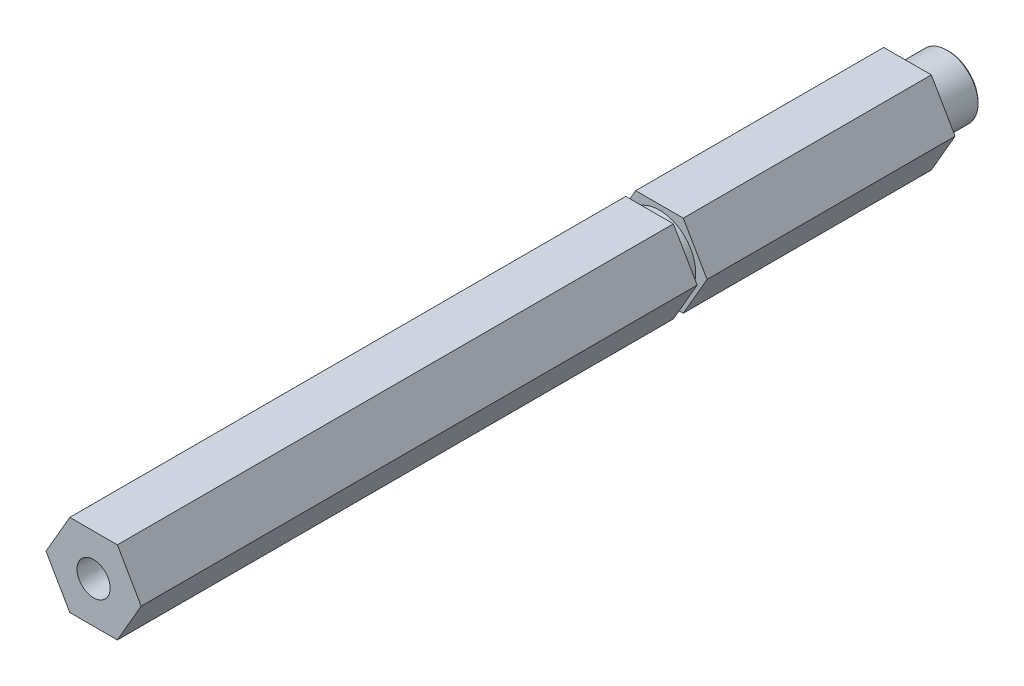
ISO-10303-21;
HEADER;
FILE_DESCRIPTION(('STEP AP214'),'2;1');
FILE_NAME('part.step','',(''),(''),'','','');
FILE_SCHEMA(('AUTOMOTIVE_DESIGN { 1 0 10303 214 1 1 1 1 }'));
ENDSEC;
DATA;
#1=APPLICATION_CONTEXT('core data for automotive mechanical design processes');
#2=APPLICATION_PROTOCOL_DEFINITION('international standard','automotive_design',2000,#1);
#3=PRODUCT_CONTEXT('',#1,'mechanical');
#4=PRODUCT('Part','Part','',(#3));
#5=PRODUCT_RELATED_PRODUCT_CATEGORY('part','',(#4));
#6=PRODUCT_DEFINITION_FORMATION('','',#4);
#7=PRODUCT_DEFINITION_CONTEXT('part definition',#1,'design');
#8=PRODUCT_DEFINITION('design','',#6,#7);
#9=PRODUCT_DEFINITION_SHAPE('','',#8);
#10=(LENGTH_UNIT() NAMED_UNIT(*) SI_UNIT(.MILLI.,.METRE.));
#11=(NAMED_UNIT(*) PLANE_ANGLE_UNIT() SI_UNIT($,.RADIAN.));
#12=(NAMED_UNIT(*) SI_UNIT($,.STERADIAN.) SOLID_ANGLE_UNIT());
#13=UNCERTAINTY_MEASURE_WITH_UNIT(LENGTH_MEASURE(1.E-05),#10,'distance_accuracy_value','');
#14=(GEOMETRIC_REPRESENTATION_CONTEXT(3) GLOBAL_UNCERTAINTY_ASSIGNED_CONTEXT((#13)) GLOBAL_UNIT_ASSIGNED_CONTEXT((#10,
#11,#12)) REPRESENTATION_CONTEXT('',''));
#15=CARTESIAN_POINT('',(0.,0.,0.));
#16=DIRECTION('',(0.,0.,1.));
#17=DIRECTION('',(1.,0.,0.));
#18=AXIS2_PLACEMENT_3D('',#15,#16,#17);
#19=CARTESIAN_POINT('',(0.,0.,11.176));
#20=DIRECTION('',(0.,0.,-1.));
#21=DIRECTION('',(-1.,0.,0.));
#22=AXIS2_PLACEMENT_3D('',#19,#20,#21);
#23=PLANE('',#22);
#24=CARTESIAN_POINT('',(0.,0.,11.176));
#25=DIRECTION('',(0.,0.,-1.));
#26=DIRECTION('',(-1.,0.,0.));
#27=AXIS2_PLACEMENT_3D('',#24,#25,#26);
#28=CIRCLE('',#27,3.175);
#29=CARTESIAN_POINT('',(-3.175,0.,11.176));
#30=VERTEX_POINT('',#29);
#31=EDGE_CURVE('E20',#30,#30,#28,.T.);
#32=ORIENTED_EDGE('',*,*,#31,.T.);
#33=EDGE_LOOP('',(#32));
#34=FACE_BOUND('',#33,.T.);
#35=ADVANCED_FACE('F17',(#34),#23,.T.);
#36=CARTESIAN_POINT('',(0.,0.,11.176));
#37=DIRECTION('',(0.,0.,-1.));
#38=DIRECTION('',(-1.,0.,0.));
#39=AXIS2_PLACEMENT_3D('',#36,#37,#38);
#40=CYLINDRICAL_SURFACE('',#39,3.175);
#41=CARTESIAN_POINT('',(0.,0.,0.254000000040833));
#42=DIRECTION('',(0.,0.,-1.));
#43=DIRECTION('',(-1.,0.,0.));
#44=AXIS2_PLACEMENT_3D('',#41,#42,#43);
#45=CIRCLE('',#44,3.17499999999882);
#46=CARTESIAN_POINT('',(-3.17499999999882,0.,0.254000000040833));
#47=VERTEX_POINT('',#46);
#48=EDGE_CURVE('E139',#47,#47,#45,.T.);
#49=ORIENTED_EDGE('',*,*,#48,.T.);
#50=EDGE_LOOP('',(#49));
#51=FACE_BOUND('',#50,.T.);
#52=ORIENTED_EDGE('',*,*,#31,.F.);
#53=EDGE_LOOP('',(#52));
#54=FACE_BOUND('',#53,.T.);
#55=ADVANCED_FACE('F401',(#51,#54),#40,.F.);
#56=CARTESIAN_POINT('',(0.,0.,5.6843418860808E-11));
#57=DIRECTION('',(0.,0.,-1.));
#58=DIRECTION('',(-1.,0.,0.));
#59=AXIS2_PLACEMENT_3D('',#56,#57,#58);
#60=CONICAL_SURFACE('',#59,3.42899999998281,0.785398163285552);
#61=CARTESIAN_POINT('',(0.,0.,0.));
#62=DIRECTION('',(0.,0.,-1.));
#63=DIRECTION('',(-1.,0.,0.));
#64=AXIS2_PLACEMENT_3D('',#61,#62,#63);
#65=CIRCLE('',#64,3.42900000003965);
#66=CARTESIAN_POINT('',(-3.42900000003965,0.,0.));
#67=VERTEX_POINT('',#66);
#68=EDGE_CURVE('E142',#67,#67,#65,.T.);
#69=ORIENTED_EDGE('',*,*,#68,.T.);
#70=EDGE_LOOP('',(#69));
#71=FACE_BOUND('',#70,.T.);
#72=ORIENTED_EDGE('',*,*,#48,.F.);
#73=EDGE_LOOP('',(#72));
#74=FACE_BOUND('',#73,.T.);
#75=ADVANCED_FACE('F163',(#71,#74),#60,.F.);
#76=CARTESIAN_POINT('',(0.,0.,0.));
#77=DIRECTION('',(0.,0.,1.));
#78=DIRECTION('',(1.,0.,0.));
#79=AXIS2_PLACEMENT_3D('',#76,#77,#78);
#80=PLANE('',#79);
#81=ORIENTED_EDGE('',*,*,#68,.F.);
#82=EDGE_LOOP('',(#81));
#83=FACE_BOUND('',#82,.T.);
#84=CARTESIAN_POINT('',(0.,0.,-5.6843418860808E-11));
#85=DIRECTION('',(0.,0.,1.));
#86=DIRECTION('',(1.,0.,0.));
#87=AXIS2_PLACEMENT_3D('',#84,#85,#86);
#88=CIRCLE('',#87,4.50850000004266);
#89=CARTESIAN_POINT('',(4.50850000004266,0.,-5.6843418860808E-11));
#90=VERTEX_POINT('',#89);
#91=EDGE_CURVE('E138',#90,#90,#88,.T.);
#92=ORIENTED_EDGE('',*,*,#91,.F.);
#93=EDGE_LOOP('',(#92));
#94=FACE_BOUND('',#93,.T.);
#95=ADVANCED_FACE('F166',(#83,#94),#80,.F.);
#96=CARTESIAN_POINT('',(0.,0.,0.253999999870302));
#97=DIRECTION('',(0.,0.,1.));
#98=DIRECTION('',(1.,0.,0.));
#99=AXIS2_PLACEMENT_3D('',#96,#97,#98);
#100=CONICAL_SURFACE('',#99,4.7624999999698,0.785398163397448);
#101=ORIENTED_EDGE('',*,*,#91,.T.);
#102=EDGE_LOOP('',(#101));
#103=FACE_BOUND('',#102,.T.);
#104=CARTESIAN_POINT('',(0.,0.,0.253999999999998));
#105=DIRECTION('',(0.,0.,-1.));
#106=DIRECTION('',(-1.,0.,0.));
#107=AXIS2_PLACEMENT_3D('',#104,#105,#106);
#108=CIRCLE('',#107,4.7625);
#109=CARTESIAN_POINT('',(-4.7625,0.,0.253999999999998));
#110=VERTEX_POINT('',#109);
#111=EDGE_CURVE('E135',#110,#110,#108,.F.);
#112=ORIENTED_EDGE('',*,*,#111,.F.);
#113=EDGE_LOOP('',(#112));
#114=FACE_BOUND('',#113,.T.);
#115=ADVANCED_FACE('F169',(#103,#114),#100,.T.);
#116=CARTESIAN_POINT('',(0.,0.,6.35));
#117=DIRECTION('',(0.,0.,-1.));
#118=DIRECTION('',(-1.,0.,0.));
#119=AXIS2_PLACEMENT_3D('',#116,#117,#118);
#120=CYLINDRICAL_SURFACE('',#119,4.7625);
#121=CARTESIAN_POINT('',(0.,0.,6.35));
#122=DIRECTION('',(0.,0.,-1.));
#123=DIRECTION('',(-1.,0.,0.));
#124=AXIS2_PLACEMENT_3D('',#121,#122,#123);
#125=CIRCLE('',#124,4.7625);
#126=CARTESIAN_POINT('',(-4.7625,0.,6.35));
#127=VERTEX_POINT('',#126);
#128=EDGE_CURVE('E117',#127,#127,#125,.T.);
#129=ORIENTED_EDGE('',*,*,#128,.T.);
#130=EDGE_LOOP('',(#129));
#131=FACE_BOUND('',#130,.T.);
#132=ORIENTED_EDGE('',*,*,#111,.T.);
#133=EDGE_LOOP('',(#132));
#134=FACE_BOUND('',#133,.T.);
#135=ADVANCED_FACE('F175',(#131,#134),#120,.T.);
#136=CARTESIAN_POINT('',(0.,0.,6.35));
#137=DIRECTION('',(0.,0.,1.));
#138=DIRECTION('',(1.,0.,0.));
#139=AXIS2_PLACEMENT_3D('',#136,#137,#138);
#140=PLANE('',#139);
#141=ORIENTED_EDGE('',*,*,#128,.F.);
#142=EDGE_LOOP('',(#141));
#143=FACE_BOUND('',#142,.T.);
#144=DIRECTION('',(-1.,0.,0.));
#145=VECTOR('',#144,1.);
#146=CARTESIAN_POINT('',(-3.66617420935412,-6.35,6.35));
#147=LINE('',#146,#145);
#148=CARTESIAN_POINT('',(3.66617420935412,-6.35,6.35));
#149=VERTEX_POINT('',#148);
#150=CARTESIAN_POINT('',(-3.66617420935412,-6.35,6.35));
#151=VERTEX_POINT('',#150);
#152=EDGE_CURVE('E481',#149,#151,#147,.T.);
#153=ORIENTED_EDGE('',*,*,#152,.T.);
#154=DIRECTION('',(-0.5,0.866025403784438,0.));
#155=VECTOR('',#154,1.);
#156=CARTESIAN_POINT('',(-7.33234841870825,0.,6.35));
#157=LINE('',#156,#155);
#158=CARTESIAN_POINT('',(-7.33234841870825,0.,6.35));
#159=VERTEX_POINT('',#158);
#160=EDGE_CURVE('E491',#151,#159,#157,.T.);
#161=ORIENTED_EDGE('',*,*,#160,.T.);
#162=DIRECTION('',(0.5,0.866025403784439,0.));
#163=VECTOR('',#162,1.);
#164=CARTESIAN_POINT('',(-3.66617420935412,6.35,6.35));
#165=LINE('',#164,#163);
#166=CARTESIAN_POINT('',(-3.66617420935412,6.35,6.35));
#167=VERTEX_POINT('',#166);
#168=EDGE_CURVE('E463',#159,#167,#165,.T.);
#169=ORIENTED_EDGE('',*,*,#168,.T.);
#170=DIRECTION('',(1.,0.,0.));
#171=VECTOR('',#170,1.);
#172=CARTESIAN_POINT('',(3.66617420935412,6.35,6.35));
#173=LINE('',#172,#171);
#174=CARTESIAN_POINT('',(3.66617420935412,6.35,6.35));
#175=VERTEX_POINT('',#174);
#176=EDGE_CURVE('E129',#167,#175,#173,.T.);
#177=ORIENTED_EDGE('',*,*,#176,.T.);
#178=DIRECTION('',(0.5,-0.866025403784439,0.));
#179=VECTOR('',#178,1.);
#180=CARTESIAN_POINT('',(7.33234841870825,0.,6.34999999999999));
#181=LINE('',#180,#179);
#182=CARTESIAN_POINT('',(7.33234841870825,0.,6.35));
#183=VERTEX_POINT('',#182);
#184=EDGE_CURVE('E122',#175,#183,#181,.T.);
#185=ORIENTED_EDGE('',*,*,#184,.T.);
#186=DIRECTION('',(-0.5,-0.866025403784439,0.));
#187=VECTOR('',#186,1.);
#188=CARTESIAN_POINT('',(3.66617420935412,-6.35,6.35));
#189=LINE('',#188,#187);
#190=EDGE_CURVE('E106',#183,#149,#189,.T.);
#191=ORIENTED_EDGE('',*,*,#190,.T.);
#192=EDGE_LOOP('',(#153,#161,#169,#177,#185,#191));
#193=FACE_BOUND('',#192,.T.);
#194=ADVANCED_FACE('F127',(#143,#193),#140,.F.);
#195=CARTESIAN_POINT('',(3.66617420935412,-6.35,44.577));
#196=DIRECTION('',(-0.866025403784439,0.5,0.));
#197=DIRECTION('',(-0.5,-0.866025403784439,0.));
#198=AXIS2_PLACEMENT_3D('',#195,#196,#197);
#199=PLANE('',#198);
#200=DIRECTION('',(0.,0.,1.));
#201=VECTOR('',#200,1.);
#202=CARTESIAN_POINT('',(7.33234841870825,0.,44.577));
#203=LINE('',#202,#201);
#204=CARTESIAN_POINT('',(7.33234841870825,0.,44.577));
#205=VERTEX_POINT('',#204);
#206=EDGE_CURVE('E110',#183,#205,#203,.T.);
#207=ORIENTED_EDGE('',*,*,#206,.T.);
#208=DIRECTION('',(0.5,0.866025403784439,0.));
#209=VECTOR('',#208,1.);
#210=CARTESIAN_POINT('',(3.66617420935412,-6.35,44.577));
#211=LINE('',#210,#209);
#212=CARTESIAN_POINT('',(3.66617420935412,-6.35,44.577));
#213=VERTEX_POINT('',#212);
#214=EDGE_CURVE('E479',#213,#205,#211,.T.);
#215=ORIENTED_EDGE('',*,*,#214,.F.);
#216=DIRECTION('',(0.,0.,1.));
#217=VECTOR('',#216,1.);
#218=CARTESIAN_POINT('',(3.66617420935412,-6.35,44.577));
#219=LINE('',#218,#217);
#220=EDGE_CURVE('E112',#213,#149,#219,.F.);
#221=ORIENTED_EDGE('',*,*,#220,.T.);
#222=ORIENTED_EDGE('',*,*,#190,.F.);
#223=EDGE_LOOP('',(#207,#215,#221,#222));
#224=FACE_BOUND('',#223,.T.);
#225=ADVANCED_FACE('F108',(#224),#199,.F.);
#226=CARTESIAN_POINT('',(7.33234841870825,0.,44.577));
#227=DIRECTION('',(-0.866025403784439,-0.5,0.));
#228=DIRECTION('',(0.5,-0.866025403784439,0.));
#229=AXIS2_PLACEMENT_3D('',#226,#227,#228);
#230=PLANE('',#229);
#231=DIRECTION('',(0.,0.,-1.));
#232=VECTOR('',#231,1.);
#233=CARTESIAN_POINT('',(3.66617420935412,6.35,44.577));
#234=LINE('',#233,#232);
#235=CARTESIAN_POINT('',(3.66617420935412,6.35,44.577));
#236=VERTEX_POINT('',#235);
#237=EDGE_CURVE('E130',#175,#236,#234,.F.);
#238=ORIENTED_EDGE('',*,*,#237,.T.);
#239=DIRECTION('',(-0.5,0.866025403784438,0.));
#240=VECTOR('',#239,1.);
#241=CARTESIAN_POINT('',(7.33234841870825,0.,44.577));
#242=LINE('',#241,#240);
#243=EDGE_CURVE('E124',#205,#236,#242,.T.);
#244=ORIENTED_EDGE('',*,*,#243,.F.);
#245=ORIENTED_EDGE('',*,*,#206,.F.);
#246=ORIENTED_EDGE('',*,*,#184,.F.);
#247=EDGE_LOOP('',(#238,#244,#245,#246));
#248=FACE_BOUND('',#247,.T.);
#249=ADVANCED_FACE('F121',(#248),#230,.F.);
#250=CARTESIAN_POINT('',(3.66617420935412,6.35,44.577));
#251=DIRECTION('',(0.,-1.,0.));
#252=DIRECTION('',(0.,0.,-1.));
#253=AXIS2_PLACEMENT_3D('',#250,#251,#252);
#254=PLANE('',#253);
#255=DIRECTION('',(0.,0.,1.));
#256=VECTOR('',#255,1.);
#257=CARTESIAN_POINT('',(-3.66617420935412,6.35,44.577));
#258=LINE('',#257,#256);
#259=CARTESIAN_POINT('',(-3.66617420935412,6.35,44.577));
#260=VERTEX_POINT('',#259);
#261=EDGE_CURVE('E460',#167,#260,#258,.T.);
#262=ORIENTED_EDGE('',*,*,#261,.T.);
#263=DIRECTION('',(1.,0.,0.));
#264=VECTOR('',#263,1.);
#265=CARTESIAN_POINT('',(0.,6.35,44.577));
#266=LINE('',#265,#264);
#267=EDGE_CURVE('E462',#236,#260,#266,.F.);
#268=ORIENTED_EDGE('',*,*,#267,.F.);
#269=ORIENTED_EDGE('',*,*,#237,.F.);
#270=ORIENTED_EDGE('',*,*,#176,.F.);
#271=EDGE_LOOP('',(#262,#268,#269,#270));
#272=FACE_BOUND('',#271,.T.);
#273=ADVANCED_FACE('F251',(#272),#254,.F.);
#274=CARTESIAN_POINT('',(-3.66617420935412,6.35,44.577));
#275=DIRECTION('',(0.866025403784439,-0.5,0.));
#276=DIRECTION('',(0.5,0.866025403784439,0.));
#277=AXIS2_PLACEMENT_3D('',#274,#275,#276);
#278=PLANE('',#277);
#279=DIRECTION('',(0.,0.,1.));
#280=VECTOR('',#279,1.);
#281=CARTESIAN_POINT('',(-7.33234841870825,0.,44.577));
#282=LINE('',#281,#280);
#283=CARTESIAN_POINT('',(-7.33234841870825,0.,44.577));
#284=VERTEX_POINT('',#283);
#285=EDGE_CURVE('E468',#159,#284,#282,.T.);
#286=ORIENTED_EDGE('',*,*,#285,.T.);
#287=DIRECTION('',(-0.5,-0.866025403784438,0.));
#288=VECTOR('',#287,1.);
#289=CARTESIAN_POINT('',(-3.66617420935412,6.35,44.577));
#290=LINE('',#289,#288);
#291=EDGE_CURVE('E466',#260,#284,#290,.T.);
#292=ORIENTED_EDGE('',*,*,#291,.F.);
#293=ORIENTED_EDGE('',*,*,#261,.F.);
#294=ORIENTED_EDGE('',*,*,#168,.F.);
#295=EDGE_LOOP('',(#286,#292,#293,#294));
#296=FACE_BOUND('',#295,.T.);
#297=ADVANCED_FACE('F247',(#296),#278,.F.);
#298=CARTESIAN_POINT('',(-7.33234841870825,0.,44.577));
#299=DIRECTION('',(0.866025403784438,0.5,0.));
#300=DIRECTION('',(-0.5,0.866025403784438,0.));
#301=AXIS2_PLACEMENT_3D('',#298,#299,#300);
#302=PLANE('',#301);
#303=DIRECTION('',(0.,0.,1.));
#304=VECTOR('',#303,1.);
#305=CARTESIAN_POINT('',(-3.66617420935412,-6.35,44.577));
#306=LINE('',#305,#304);
#307=CARTESIAN_POINT('',(-3.66617420935412,-6.35,44.577));
#308=VERTEX_POINT('',#307);
#309=EDGE_CURVE('E488',#151,#308,#306,.T.);
#310=ORIENTED_EDGE('',*,*,#309,.T.);
#311=DIRECTION('',(0.5,-0.866025403784438,0.));
#312=VECTOR('',#311,1.);
#313=CARTESIAN_POINT('',(-7.33234841870825,0.,44.577));
#314=LINE('',#313,#312);
#315=EDGE_CURVE('E471',#284,#308,#314,.T.);
#316=ORIENTED_EDGE('',*,*,#315,.F.);
#317=ORIENTED_EDGE('',*,*,#285,.F.);
#318=ORIENTED_EDGE('',*,*,#160,.F.);
#319=EDGE_LOOP('',(#310,#316,#317,#318));
#320=FACE_BOUND('',#319,.T.);
#321=ADVANCED_FACE('F243',(#320),#302,.F.);
#322=CARTESIAN_POINT('',(-3.66617420935412,-6.35,44.577));
#323=DIRECTION('',(0.,1.,0.));
#324=DIRECTION('',(-1.,0.,0.));
#325=AXIS2_PLACEMENT_3D('',#322,#323,#324);
#326=PLANE('',#325);
#327=ORIENTED_EDGE('',*,*,#220,.F.);
#328=DIRECTION('',(1.,0.,0.));
#329=VECTOR('',#328,1.);
#330=CARTESIAN_POINT('',(0.,-6.35,44.577));
#331=LINE('',#330,#329);
#332=EDGE_CURVE('E473',#308,#213,#331,.T.);
#333=ORIENTED_EDGE('',*,*,#332,.F.);
#334=ORIENTED_EDGE('',*,*,#309,.F.);
#335=ORIENTED_EDGE('',*,*,#152,.F.);
#336=EDGE_LOOP('',(#327,#333,#334,#335));
#337=FACE_BOUND('',#336,.T.);
#338=ADVANCED_FACE('F239',(#337),#326,.F.);
#339=CARTESIAN_POINT('',(0.,0.,115.267739999922));
#340=DIRECTION('',(0.,0.,1.));
#341=DIRECTION('',(1.,0.,0.));
#342=AXIS2_PLACEMENT_3D('',#339,#340,#341);
#343=CONICAL_SURFACE('',#342,2.55269999991015,1.02974425853382);
#344=CARTESIAN_POINT('',(-1.70530256582424E-10,0.,113.733923097698));
#345=VERTEX_POINT('',#344);
#346=VERTEX_LOOP('',#345);
#347=FACE_BOUND('',#346,.T.);
#348=CARTESIAN_POINT('',(0.,0.,115.26774));
#349=DIRECTION('',(0.,0.,1.));
#350=DIRECTION('',(1.,0.,0.));
#351=AXIS2_PLACEMENT_3D('',#348,#349,#350);
#352=CIRCLE('',#351,2.55269999999999);
#353=CARTESIAN_POINT('',(2.55269999999999,0.,115.26774));
#354=VERTEX_POINT('',#353);
#355=EDGE_CURVE('E482',#354,#354,#352,.T.);
#356=ORIENTED_EDGE('',*,*,#355,.T.);
#357=EDGE_LOOP('',(#356));
#358=FACE_BOUND('',#357,.T.);
#359=ADVANCED_FACE('F235',(#347,#358),#343,.F.);
#360=CARTESIAN_POINT('',(0.,0.,44.577));
#361=DIRECTION('',(0.,0.,1.));
#362=DIRECTION('',(1.,0.,0.));
#363=AXIS2_PLACEMENT_3D('',#360,#361,#362);
#364=PLANE('',#363);
#365=CARTESIAN_POINT('',(0.,0.,44.577));
#366=DIRECTION('',(0.,0.,-1.));
#367=DIRECTION('',(-1.,0.,0.));
#368=AXIS2_PLACEMENT_3D('',#365,#366,#367);
#369=CIRCLE('',#368,5.588);
#370=CARTESIAN_POINT('',(-5.588,0.,44.577));
#371=VERTEX_POINT('',#370);
#372=EDGE_CURVE('E153',#371,#371,#369,.F.);
#373=ORIENTED_EDGE('',*,*,#372,.F.);
#374=EDGE_LOOP('',(#373));
#375=FACE_BOUND('',#374,.T.);
#376=ORIENTED_EDGE('',*,*,#315,.T.);
#377=ORIENTED_EDGE('',*,*,#332,.T.);
#378=ORIENTED_EDGE('',*,*,#214,.T.);
#379=ORIENTED_EDGE('',*,*,#243,.T.);
#380=ORIENTED_EDGE('',*,*,#267,.T.);
#381=ORIENTED_EDGE('',*,*,#291,.T.);
#382=EDGE_LOOP('',(#376,#377,#378,#379,#380,#381));
#383=FACE_BOUND('',#382,.T.);
#384=ADVANCED_FACE('F231',(#375,#383),#364,.T.);
#385=CARTESIAN_POINT('',(0.,0.,131.77774));
#386=DIRECTION('',(0.,0.,1.));
#387=DIRECTION('',(1.,0.,0.));
#388=AXIS2_PLACEMENT_3D('',#385,#386,#387);
#389=CYLINDRICAL_SURFACE('',#388,2.55269999999999);
#390=CARTESIAN_POINT('',(0.,0.,131.77774));
#391=DIRECTION('',(0.,0.,1.));
#392=DIRECTION('',(1.,0.,0.));
#393=AXIS2_PLACEMENT_3D('',#390,#391,#392);
#394=CIRCLE('',#393,2.55269999999999);
#395=CARTESIAN_POINT('',(2.55269999999999,0.,131.77774));
#396=VERTEX_POINT('',#395);
#397=EDGE_CURVE('E148',#396,#396,#394,.F.);
#398=ORIENTED_EDGE('',*,*,#397,.F.);
#399=EDGE_LOOP('',(#398));
#400=FACE_BOUND('',#399,.T.);
#401=ORIENTED_EDGE('',*,*,#355,.F.);
#402=EDGE_LOOP('',(#401));
#403=FACE_BOUND('',#402,.T.);
#404=ADVANCED_FACE('F227',(#400,#403),#389,.F.);
#405=CARTESIAN_POINT('',(3.66617420935412,6.35,131.77774));
#406=DIRECTION('',(0.,-1.,0.));
#407=DIRECTION('',(1.,0.,0.));
#408=AXIS2_PLACEMENT_3D('',#405,#406,#407);
#409=PLANE('',#408);
#410=DIRECTION('',(0.,0.,1.));
#411=VECTOR('',#410,1.);
#412=CARTESIAN_POINT('',(-3.66617420935413,6.35,131.77774));
#413=LINE('',#412,#411);
#414=CARTESIAN_POINT('',(-3.66617420935413,6.35,46.101));
#415=VERTEX_POINT('',#414);
#416=CARTESIAN_POINT('',(-3.66617420935413,6.35,131.77774));
#417=VERTEX_POINT('',#416);
#418=EDGE_CURVE('E485',#415,#417,#413,.T.);
#419=ORIENTED_EDGE('',*,*,#418,.T.);
#420=DIRECTION('',(1.,0.,0.));
#421=VECTOR('',#420,1.);
#422=CARTESIAN_POINT('',(0.,6.35,131.77774));
#423=LINE('',#422,#421);
#424=CARTESIAN_POINT('',(3.66617420935412,6.35,131.77774));
#425=VERTEX_POINT('',#424);
#426=EDGE_CURVE('E151',#425,#417,#423,.F.);
#427=ORIENTED_EDGE('',*,*,#426,.F.);
#428=DIRECTION('',(0.,0.,1.));
#429=VECTOR('',#428,1.);
#430=CARTESIAN_POINT('',(3.66617420935412,6.35,131.77774));
#431=LINE('',#430,#429);
#432=CARTESIAN_POINT('',(3.66617420935412,6.35,46.101));
#433=VERTEX_POINT('',#432);
#434=EDGE_CURVE('E515',#425,#433,#431,.F.);
#435=ORIENTED_EDGE('',*,*,#434,.T.);
#436=DIRECTION('',(1.,0.,0.));
#437=VECTOR('',#436,1.);
#438=CARTESIAN_POINT('',(0.,6.35,46.101));
#439=LINE('',#438,#437);
#440=EDGE_CURVE('E518',#433,#415,#439,.F.);
#441=ORIENTED_EDGE('',*,*,#440,.T.);
#442=EDGE_LOOP('',(#419,#427,#435,#441));
#443=FACE_BOUND('',#442,.T.);
#444=ADVANCED_FACE('F223',(#443),#409,.F.);
#445=CARTESIAN_POINT('',(-3.66617420935413,6.35,131.77774));
#446=DIRECTION('',(0.866025403784439,-0.499999999999999,0.));
#447=DIRECTION('',(0.499999999999999,0.866025403784439,0.));
#448=AXIS2_PLACEMENT_3D('',#445,#446,#447);
#449=PLANE('',#448);
#450=DIRECTION('',(0.,0.,1.));
#451=VECTOR('',#450,1.);
#452=CARTESIAN_POINT('',(-7.33234841870824,0.,131.77774));
#453=LINE('',#452,#451);
#454=CARTESIAN_POINT('',(-7.33234841870825,0.,46.101));
#455=VERTEX_POINT('',#454);
#456=CARTESIAN_POINT('',(-7.33234841870825,0.,131.77774));
#457=VERTEX_POINT('',#456);
#458=EDGE_CURVE('E156',#455,#457,#453,.T.);
#459=ORIENTED_EDGE('',*,*,#458,.T.);
#460=DIRECTION('',(-0.499999999999999,-0.866025403784439,0.));
#461=VECTOR('',#460,1.);
#462=CARTESIAN_POINT('',(-3.66617420935413,6.35,131.77774));
#463=LINE('',#462,#461);
#464=EDGE_CURVE('E506',#417,#457,#463,.T.);
#465=ORIENTED_EDGE('',*,*,#464,.F.);
#466=ORIENTED_EDGE('',*,*,#418,.F.);
#467=DIRECTION('',(-0.499999999999999,-0.866025403784439,0.));
#468=VECTOR('',#467,1.);
#469=CARTESIAN_POINT('',(-3.66617420935413,6.35,46.101));
#470=LINE('',#469,#468);
#471=EDGE_CURVE('E521',#415,#455,#470,.T.);
#472=ORIENTED_EDGE('',*,*,#471,.T.);
#473=EDGE_LOOP('',(#459,#465,#466,#472));
#474=FACE_BOUND('',#473,.T.);
#475=ADVANCED_FACE('F219',(#474),#449,.F.);
#476=CARTESIAN_POINT('',(-7.33234841870824,0.,131.77774));
#477=DIRECTION('',(0.866025403784438,0.5,0.));
#478=DIRECTION('',(-0.5,0.866025403784438,0.));
#479=AXIS2_PLACEMENT_3D('',#476,#477,#478);
#480=PLANE('',#479);
#481=DIRECTION('',(0.,0.,1.));
#482=VECTOR('',#481,1.);
#483=CARTESIAN_POINT('',(-3.66617420935412,-6.35,131.77774));
#484=LINE('',#483,#482);
#485=CARTESIAN_POINT('',(-3.66617420935412,-6.35,46.101));
#486=VERTEX_POINT('',#485);
#487=CARTESIAN_POINT('',(-3.66617420935412,-6.35,131.77774));
#488=VERTEX_POINT('',#487);
#489=EDGE_CURVE('E152',#486,#488,#484,.T.);
#490=ORIENTED_EDGE('',*,*,#489,.T.);
#491=DIRECTION('',(0.5,-0.866025403784439,0.));
#492=VECTOR('',#491,1.);
#493=CARTESIAN_POINT('',(-7.33234841870824,0.,131.77774));
#494=LINE('',#493,#492);
#495=EDGE_CURVE('E508',#457,#488,#494,.T.);
#496=ORIENTED_EDGE('',*,*,#495,.F.);
#497=ORIENTED_EDGE('',*,*,#458,.F.);
#498=DIRECTION('',(0.5,-0.866025403784439,0.));
#499=VECTOR('',#498,1.);
#500=CARTESIAN_POINT('',(-7.33234841870824,0.,46.101));
#501=LINE('',#500,#499);
#502=EDGE_CURVE('E524',#455,#486,#501,.T.);
#503=ORIENTED_EDGE('',*,*,#502,.T.);
#504=EDGE_LOOP('',(#490,#496,#497,#503));
#505=FACE_BOUND('',#504,.T.);
#506=ADVANCED_FACE('F215',(#505),#480,.F.);
#507=CARTESIAN_POINT('',(0.,0.,46.101));
#508=DIRECTION('',(0.,0.,-1.));
#509=DIRECTION('',(-1.,0.,0.));
#510=AXIS2_PLACEMENT_3D('',#507,#508,#509);
#511=CYLINDRICAL_SURFACE('',#510,5.588);
#512=CARTESIAN_POINT('',(0.,0.,46.101));
#513=DIRECTION('',(0.,0.,-1.));
#514=DIRECTION('',(-1.,0.,0.));
#515=AXIS2_PLACEMENT_3D('',#512,#513,#514);
#516=CIRCLE('',#515,5.588);
#517=CARTESIAN_POINT('',(-5.588,0.,46.101));
#518=VERTEX_POINT('',#517);
#519=EDGE_CURVE('E143',#518,#518,#516,.T.);
#520=ORIENTED_EDGE('',*,*,#519,.T.);
#521=EDGE_LOOP('',(#520));
#522=FACE_BOUND('',#521,.T.);
#523=ORIENTED_EDGE('',*,*,#372,.T.);
#524=EDGE_LOOP('',(#523));
#525=FACE_BOUND('',#524,.T.);
#526=ADVANCED_FACE('F211',(#522,#525),#511,.T.);
#527=CARTESIAN_POINT('',(-3.66617420935412,-6.35,131.77774));
#528=DIRECTION('',(0.,1.,0.));
#529=DIRECTION('',(-1.,0.,0.));
#530=AXIS2_PLACEMENT_3D('',#527,#528,#529);
#531=PLANE('',#530);
#532=DIRECTION('',(0.,0.,1.));
#533=VECTOR('',#532,1.);
#534=CARTESIAN_POINT('',(3.66617420935413,-6.35,131.77774));
#535=LINE('',#534,#533);
#536=CARTESIAN_POINT('',(3.66617420935413,-6.35,46.101));
#537=VERTEX_POINT('',#536);
#538=CARTESIAN_POINT('',(3.66617420935413,-6.35,131.77774));
#539=VERTEX_POINT('',#538);
#540=EDGE_CURVE('E146',#537,#539,#535,.T.);
#541=ORIENTED_EDGE('',*,*,#540,.T.);
#542=DIRECTION('',(1.,0.,0.));
#543=VECTOR('',#542,1.);
#544=CARTESIAN_POINT('',(0.,-6.35,131.77774));
#545=LINE('',#544,#543);
#546=EDGE_CURVE('E510',#488,#539,#545,.T.);
#547=ORIENTED_EDGE('',*,*,#546,.F.);
#548=ORIENTED_EDGE('',*,*,#489,.F.);
#549=DIRECTION('',(1.,0.,0.));
#550=VECTOR('',#549,1.);
#551=CARTESIAN_POINT('',(0.,-6.35,46.101));
#552=LINE('',#551,#550);
#553=EDGE_CURVE('E147',#486,#537,#552,.T.);
#554=ORIENTED_EDGE('',*,*,#553,.T.);
#555=EDGE_LOOP('',(#541,#547,#548,#554));
#556=FACE_BOUND('',#555,.T.);
#557=ADVANCED_FACE('F207',(#556),#531,.F.);
#558=CARTESIAN_POINT('',(0.,0.,131.77774));
#559=DIRECTION('',(0.,0.,1.));
#560=DIRECTION('',(1.,0.,0.));
#561=AXIS2_PLACEMENT_3D('',#558,#559,#560);
#562=PLANE('',#561);
#563=ORIENTED_EDGE('',*,*,#495,.T.);
#564=ORIENTED_EDGE('',*,*,#546,.T.);
#565=DIRECTION('',(-0.499999999999999,-0.866025403784439,0.));
#566=VECTOR('',#565,1.);
#567=CARTESIAN_POINT('',(3.66617420935413,-6.35,131.77774));
#568=LINE('',#567,#566);
#569=CARTESIAN_POINT('',(7.33234841870824,0.,131.77774));
#570=VERTEX_POINT('',#569);
#571=EDGE_CURVE('E531',#539,#570,#568,.F.);
#572=ORIENTED_EDGE('',*,*,#571,.T.);
#573=DIRECTION('',(0.5,-0.866025403784439,0.));
#574=VECTOR('',#573,1.);
#575=CARTESIAN_POINT('',(7.33234841870824,0.,131.77774));
#576=LINE('',#575,#574);
#577=EDGE_CURVE('E512',#570,#425,#576,.F.);
#578=ORIENTED_EDGE('',*,*,#577,.T.);
#579=ORIENTED_EDGE('',*,*,#426,.T.);
#580=ORIENTED_EDGE('',*,*,#464,.T.);
#581=EDGE_LOOP('',(#563,#564,#572,#578,#579,#580));
#582=FACE_BOUND('',#581,.T.);
#583=ORIENTED_EDGE('',*,*,#397,.T.);
#584=EDGE_LOOP('',(#583));
#585=FACE_BOUND('',#584,.T.);
#586=ADVANCED_FACE('F203',(#582,#585),#562,.T.);
#587=CARTESIAN_POINT('',(7.33234841870824,0.,131.77774));
#588=DIRECTION('',(-0.866025403784439,-0.5,0.));
#589=DIRECTION('',(0.5,-0.866025403784439,0.));
#590=AXIS2_PLACEMENT_3D('',#587,#588,#589);
#591=PLANE('',#590);
#592=ORIENTED_EDGE('',*,*,#434,.F.);
#593=ORIENTED_EDGE('',*,*,#577,.F.);
#594=DIRECTION('',(0.,0.,1.));
#595=VECTOR('',#594,1.);
#596=CARTESIAN_POINT('',(7.33234841870824,0.,131.77774));
#597=LINE('',#596,#595);
#598=CARTESIAN_POINT('',(7.33234841870824,0.,46.101));
#599=VERTEX_POINT('',#598);
#600=EDGE_CURVE('E26',#570,#599,#597,.F.);
#601=ORIENTED_EDGE('',*,*,#600,.T.);
#602=DIRECTION('',(-0.5,0.866025403784439,0.));
#603=VECTOR('',#602,1.);
#604=CARTESIAN_POINT('',(7.33234841870824,0.,46.101));
#605=LINE('',#604,#603);
#606=EDGE_CURVE('E34',#599,#433,#605,.T.);
#607=ORIENTED_EDGE('',*,*,#606,.T.);
#608=EDGE_LOOP('',(#592,#593,#601,#607));
#609=FACE_BOUND('',#608,.T.);
#610=ADVANCED_FACE('F196',(#609),#591,.F.);
#611=CARTESIAN_POINT('',(0.,0.,46.101));
#612=DIRECTION('',(0.,0.,1.));
#613=DIRECTION('',(1.,0.,0.));
#614=AXIS2_PLACEMENT_3D('',#611,#612,#613);
#615=PLANE('',#614);
#616=ORIENTED_EDGE('',*,*,#519,.F.);
#617=EDGE_LOOP('',(#616));
#618=FACE_BOUND('',#617,.T.);
#619=ORIENTED_EDGE('',*,*,#553,.F.);
#620=ORIENTED_EDGE('',*,*,#502,.F.);
#621=ORIENTED_EDGE('',*,*,#471,.F.);
#622=ORIENTED_EDGE('',*,*,#440,.F.);
#623=ORIENTED_EDGE('',*,*,#606,.F.);
#624=DIRECTION('',(-0.499999999999999,-0.866025403784439,0.));
#625=VECTOR('',#624,1.);
#626=CARTESIAN_POINT('',(3.66617420935413,-6.35,46.101));
#627=LINE('',#626,#625);
#628=EDGE_CURVE('E11',#599,#537,#627,.T.);
#629=ORIENTED_EDGE('',*,*,#628,.T.);
#630=EDGE_LOOP('',(#619,#620,#621,#622,#623,#629));
#631=FACE_BOUND('',#630,.T.);
#632=ADVANCED_FACE('F190',(#618,#631),#615,.F.);
#633=CARTESIAN_POINT('',(3.66617420935413,-6.35,131.77774));
#634=DIRECTION('',(-0.866025403784439,0.499999999999999,0.));
#635=DIRECTION('',(-0.499999999999999,-0.866025403784439,0.));
#636=AXIS2_PLACEMENT_3D('',#633,#634,#635);
#637=PLANE('',#636);
#638=ORIENTED_EDGE('',*,*,#600,.F.);
#639=ORIENTED_EDGE('',*,*,#571,.F.);
#640=ORIENTED_EDGE('',*,*,#540,.F.);
#641=ORIENTED_EDGE('',*,*,#628,.F.);
#642=EDGE_LOOP('',(#638,#639,#640,#641));
#643=FACE_BOUND('',#642,.T.);
#644=ADVANCED_FACE('F188',(#643),#637,.F.);
#645=CLOSED_SHELL('',(#35,#55,#75,#95,#115,#135,#194,#225,#249,#273,#297,#321,#338,#359,#384,
#404,#444,#475,#506,#526,#557,#586,#610,#632,#644));
#646=MANIFOLD_SOLID_BREP('B1',#645);
#647=ADVANCED_BREP_SHAPE_REPRESENTATION('',(#18,#646),#14);
#648=SHAPE_DEFINITION_REPRESENTATION(#9,#647);
ENDSEC;
END-ISO-10303-21;
